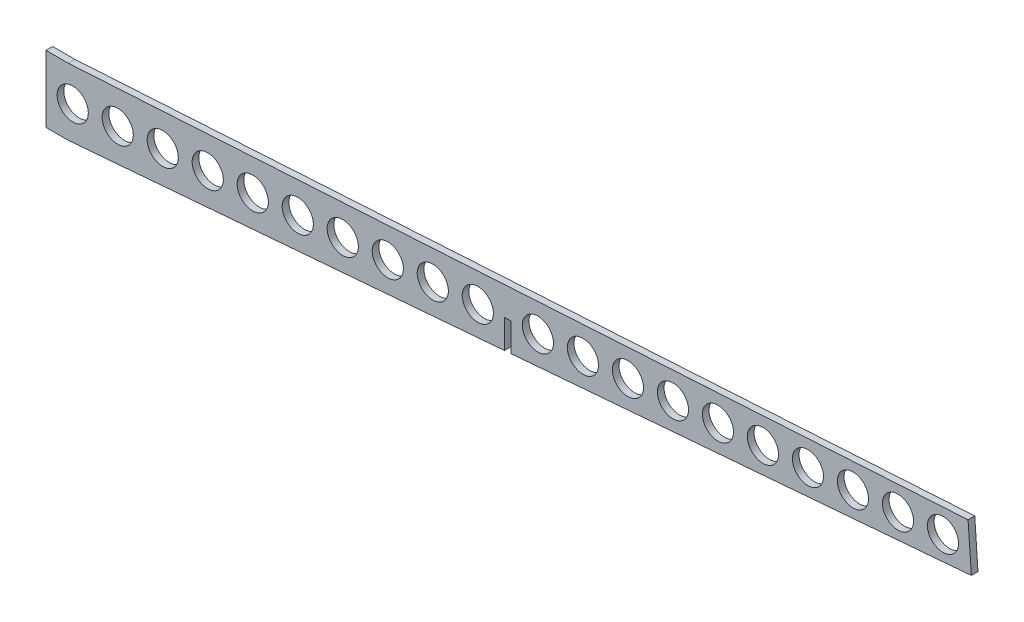
ISO-10303-21;
HEADER;
FILE_DESCRIPTION(('STEP AP214'),'2;1');
FILE_NAME('part.step','',(''),(''),'','','');
FILE_SCHEMA(('AUTOMOTIVE_DESIGN { 1 0 10303 214 1 1 1 1 }'));
ENDSEC;
DATA;
#1=APPLICATION_CONTEXT('core data for automotive mechanical design processes');
#2=APPLICATION_PROTOCOL_DEFINITION('international standard','automotive_design',2000,#1);
#3=PRODUCT_CONTEXT('',#1,'mechanical');
#4=PRODUCT('Part','Part','',(#3));
#5=PRODUCT_RELATED_PRODUCT_CATEGORY('part','',(#4));
#6=PRODUCT_DEFINITION_FORMATION('','',#4);
#7=PRODUCT_DEFINITION_CONTEXT('part definition',#1,'design');
#8=PRODUCT_DEFINITION('design','',#6,#7);
#9=PRODUCT_DEFINITION_SHAPE('','',#8);
#10=(LENGTH_UNIT() NAMED_UNIT(*) SI_UNIT(.MILLI.,.METRE.));
#11=(NAMED_UNIT(*) PLANE_ANGLE_UNIT() SI_UNIT($,.RADIAN.));
#12=(NAMED_UNIT(*) SI_UNIT($,.STERADIAN.) SOLID_ANGLE_UNIT());
#13=UNCERTAINTY_MEASURE_WITH_UNIT(LENGTH_MEASURE(1.E-05),#10,'distance_accuracy_value','');
#14=(GEOMETRIC_REPRESENTATION_CONTEXT(3) GLOBAL_UNCERTAINTY_ASSIGNED_CONTEXT((#13)) GLOBAL_UNIT_ASSIGNED_CONTEXT((#10,
#11,#12)) REPRESENTATION_CONTEXT('',''));
#15=CARTESIAN_POINT('',(0.,0.,0.));
#16=DIRECTION('',(0.,0.,1.));
#17=DIRECTION('',(1.,0.,0.));
#18=AXIS2_PLACEMENT_3D('',#15,#16,#17);
#19=CARTESIAN_POINT('',(-405.,0.,3.));
#20=DIRECTION('',(-0.0823970017996302,0.9965995856383,0.));
#21=DIRECTION('',(-0.9965995856383,-0.0823970017996302,0.));
#22=AXIS2_PLACEMENT_3D('',#19,#20,#21);
#23=PLANE('',#22);
#24=DIRECTION('',(0.9965995856383,0.0823970017996302,0.));
#25=VECTOR('',#24,1.);
#26=CARTESIAN_POINT('',(-405.,0.,3.));
#27=LINE('',#26,#25);
#28=CARTESIAN_POINT('',(-206.,16.4529502063003,3.));
#29=VERTEX_POINT('',#28);
#30=CARTESIAN_POINT('',(0.732442974313287,33.5452044288288,3.));
#31=VERTEX_POINT('',#30);
#32=EDGE_CURVE('E114',#29,#31,#27,.T.);
#33=ORIENTED_EDGE('',*,*,#32,.F.);
#34=DIRECTION('',(0.,0.,-1.));
#35=VECTOR('',#34,1.);
#36=CARTESIAN_POINT('',(-206.,16.4529502063003,3.));
#37=LINE('',#36,#35);
#38=CARTESIAN_POINT('',(-206.,16.4529502063003,0.));
#39=VERTEX_POINT('',#38);
#40=EDGE_CURVE('E312',#29,#39,#37,.T.);
#41=ORIENTED_EDGE('',*,*,#40,.T.);
#42=DIRECTION('',(0.9965995856383,0.0823970017996302,0.));
#43=VECTOR('',#42,1.);
#44=CARTESIAN_POINT('',(-405.,0.,0.));
#45=LINE('',#44,#43);
#46=CARTESIAN_POINT('',(0.732442974313287,33.5452044288288,0.));
#47=VERTEX_POINT('',#46);
#48=EDGE_CURVE('E132',#39,#47,#45,.T.);
#49=ORIENTED_EDGE('',*,*,#48,.T.);
#50=DIRECTION('',(0.,0.,-1.));
#51=VECTOR('',#50,1.);
#52=CARTESIAN_POINT('',(0.732442974313287,33.5452044288288,3.));
#53=LINE('',#52,#51);
#54=EDGE_CURVE('E130',#31,#47,#53,.T.);
#55=ORIENTED_EDGE('',*,*,#54,.F.);
#56=EDGE_LOOP('',(#33,#41,#49,#55));
#57=FACE_BOUND('',#56,.T.);
#58=ADVANCED_FACE('F43',(#57),#23,.F.);
#59=CARTESIAN_POINT('',(-415.,30.,3.));
#60=DIRECTION('',(0.,-1.,0.));
#61=DIRECTION('',(0.,0.,-1.));
#62=AXIS2_PLACEMENT_3D('',#59,#60,#61);
#63=PLANE('',#62);
#64=DIRECTION('',(-1.,0.,0.));
#65=VECTOR('',#64,1.);
#66=CARTESIAN_POINT('',(-415.,30.,0.));
#67=LINE('',#66,#65);
#68=CARTESIAN_POINT('',(-405.,30.,0.));
#69=VERTEX_POINT('',#68);
#70=CARTESIAN_POINT('',(-415.,30.,0.));
#71=VERTEX_POINT('',#70);
#72=EDGE_CURVE('E149',#69,#71,#67,.T.);
#73=ORIENTED_EDGE('',*,*,#72,.T.);
#74=DIRECTION('',(0.,0.,-1.));
#75=VECTOR('',#74,1.);
#76=CARTESIAN_POINT('',(-415.,30.,3.));
#77=LINE('',#76,#75);
#78=CARTESIAN_POINT('',(-415.,30.,3.));
#79=VERTEX_POINT('',#78);
#80=EDGE_CURVE('E52',#79,#71,#77,.T.);
#81=ORIENTED_EDGE('',*,*,#80,.F.);
#82=DIRECTION('',(-1.,0.,0.));
#83=VECTOR('',#82,1.);
#84=CARTESIAN_POINT('',(-415.,30.,3.));
#85=LINE('',#84,#83);
#86=CARTESIAN_POINT('',(-405.,30.,3.));
#87=VERTEX_POINT('',#86);
#88=EDGE_CURVE('E169',#87,#79,#85,.T.);
#89=ORIENTED_EDGE('',*,*,#88,.F.);
#90=DIRECTION('',(0.,0.,-1.));
#91=VECTOR('',#90,1.);
#92=CARTESIAN_POINT('',(-405.,30.,3.));
#93=LINE('',#92,#91);
#94=EDGE_CURVE('E144',#87,#69,#93,.T.);
#95=ORIENTED_EDGE('',*,*,#94,.T.);
#96=EDGE_LOOP('',(#73,#81,#89,#95));
#97=FACE_BOUND('',#96,.T.);
#98=ADVANCED_FACE('F45',(#97),#63,.F.);
#99=CARTESIAN_POINT('',(-415.,0.,3.));
#100=DIRECTION('',(1.,0.,0.));
#101=DIRECTION('',(0.,0.,-1.));
#102=AXIS2_PLACEMENT_3D('',#99,#100,#101);
#103=PLANE('',#102);
#104=DIRECTION('',(0.,-1.,0.));
#105=VECTOR('',#104,1.);
#106=CARTESIAN_POINT('',(-415.,0.,0.));
#107=LINE('',#106,#105);
#108=CARTESIAN_POINT('',(-415.,0.,0.));
#109=VERTEX_POINT('',#108);
#110=EDGE_CURVE('E153',#71,#109,#107,.T.);
#111=ORIENTED_EDGE('',*,*,#110,.T.);
#112=DIRECTION('',(0.,0.,-1.));
#113=VECTOR('',#112,1.);
#114=CARTESIAN_POINT('',(-415.,0.,3.));
#115=LINE('',#114,#113);
#116=CARTESIAN_POINT('',(-415.,0.,3.));
#117=VERTEX_POINT('',#116);
#118=EDGE_CURVE('E177',#117,#109,#115,.T.);
#119=ORIENTED_EDGE('',*,*,#118,.F.);
#120=DIRECTION('',(0.,-1.,0.));
#121=VECTOR('',#120,1.);
#122=CARTESIAN_POINT('',(-415.,0.,3.));
#123=LINE('',#122,#121);
#124=EDGE_CURVE('E104',#79,#117,#123,.T.);
#125=ORIENTED_EDGE('',*,*,#124,.F.);
#126=ORIENTED_EDGE('',*,*,#80,.T.);
#127=EDGE_LOOP('',(#111,#119,#125,#126));
#128=FACE_BOUND('',#127,.T.);
#129=ADVANCED_FACE('F182',(#128),#103,.F.);
#130=CARTESIAN_POINT('',(-415.,0.,3.));
#131=DIRECTION('',(0.,1.,0.));
#132=DIRECTION('',(0.,0.,1.));
#133=AXIS2_PLACEMENT_3D('',#130,#131,#132);
#134=PLANE('',#133);
#135=DIRECTION('',(1.,0.,0.));
#136=VECTOR('',#135,1.);
#137=CARTESIAN_POINT('',(-415.,0.,0.));
#138=LINE('',#137,#136);
#139=CARTESIAN_POINT('',(-405.,0.,0.));
#140=VERTEX_POINT('',#139);
#141=EDGE_CURVE('E157',#109,#140,#138,.T.);
#142=ORIENTED_EDGE('',*,*,#141,.T.);
#143=DIRECTION('',(0.,0.,-1.));
#144=VECTOR('',#143,1.);
#145=CARTESIAN_POINT('',(-405.,0.,3.));
#146=LINE('',#145,#144);
#147=CARTESIAN_POINT('',(-405.,0.,3.));
#148=VERTEX_POINT('',#147);
#149=EDGE_CURVE('E136',#148,#140,#146,.T.);
#150=ORIENTED_EDGE('',*,*,#149,.F.);
#151=DIRECTION('',(1.,0.,0.));
#152=VECTOR('',#151,1.);
#153=CARTESIAN_POINT('',(-415.,0.,3.));
#154=LINE('',#153,#152);
#155=EDGE_CURVE('E127',#117,#148,#154,.T.);
#156=ORIENTED_EDGE('',*,*,#155,.F.);
#157=ORIENTED_EDGE('',*,*,#118,.T.);
#158=EDGE_LOOP('',(#142,#150,#156,#157));
#159=FACE_BOUND('',#158,.T.);
#160=ADVANCED_FACE('F192',(#159),#134,.F.);
#161=CARTESIAN_POINT('',(-209.,16.2049157810796,0.));
#162=VERTEX_POINT('',#161);
#163=EDGE_CURVE('E160',#140,#162,#45,.T.);
#164=ORIENTED_EDGE('',*,*,#163,.T.);
#165=DIRECTION('',(0.,0.,1.));
#166=VECTOR('',#165,1.);
#167=CARTESIAN_POINT('',(-209.,16.2049157810796,0.));
#168=LINE('',#167,#166);
#169=CARTESIAN_POINT('',(-209.,16.2049157810796,3.));
#170=VERTEX_POINT('',#169);
#171=EDGE_CURVE('E200',#162,#170,#168,.T.);
#172=ORIENTED_EDGE('',*,*,#171,.T.);
#173=EDGE_CURVE('E126',#148,#170,#27,.T.);
#174=ORIENTED_EDGE('',*,*,#173,.F.);
#175=ORIENTED_EDGE('',*,*,#149,.T.);
#176=EDGE_LOOP('',(#164,#172,#174,#175));
#177=FACE_BOUND('',#176,.T.);
#178=ADVANCED_FACE('F196',(#177),#23,.F.);
#179=CARTESIAN_POINT('',(-0.732442974313352,54.4940494842851,3.));
#180=DIRECTION('',(-0.997564050259824,-0.0697564737441257,0.));
#181=DIRECTION('',(0.0697564737441257,-0.997564050259824,0.));
#182=AXIS2_PLACEMENT_3D('',#179,#180,#181);
#183=PLANE('',#182);
#184=DIRECTION('',(-0.0697564737441256,0.997564050259824,0.));
#185=VECTOR('',#184,1.);
#186=CARTESIAN_POINT('',(-0.732442974313352,54.4940494842851,0.));
#187=LINE('',#186,#185);
#188=CARTESIAN_POINT('',(-0.732442974313352,54.4940494842851,0.));
#189=VERTEX_POINT('',#188);
#190=EDGE_CURVE('E164',#47,#189,#187,.T.);
#191=ORIENTED_EDGE('',*,*,#190,.T.);
#192=DIRECTION('',(0.,0.,-1.));
#193=VECTOR('',#192,1.);
#194=CARTESIAN_POINT('',(-0.732442974313352,54.4940494842851,3.));
#195=LINE('',#194,#193);
#196=CARTESIAN_POINT('',(-0.732442974313352,54.4940494842851,3.));
#197=VERTEX_POINT('',#196);
#198=EDGE_CURVE('E137',#197,#189,#195,.T.);
#199=ORIENTED_EDGE('',*,*,#198,.F.);
#200=DIRECTION('',(-0.0697564737441256,0.997564050259824,0.));
#201=VECTOR('',#200,1.);
#202=CARTESIAN_POINT('',(-0.732442974313352,54.4940494842851,3.));
#203=LINE('',#202,#201);
#204=EDGE_CURVE('E118',#31,#197,#203,.T.);
#205=ORIENTED_EDGE('',*,*,#204,.F.);
#206=ORIENTED_EDGE('',*,*,#54,.T.);
#207=EDGE_LOOP('',(#191,#199,#205,#206));
#208=FACE_BOUND('',#207,.T.);
#209=ADVANCED_FACE('F139',(#208),#183,.F.);
#210=CARTESIAN_POINT('',(-405.,30.,3.));
#211=DIRECTION('',(0.0604778042120322,-0.99816954231117,0.));
#212=DIRECTION('',(0.99816954231117,0.0604778042120322,0.));
#213=AXIS2_PLACEMENT_3D('',#210,#211,#212);
#214=PLANE('',#213);
#215=DIRECTION('',(-0.99816954231117,-0.0604778042120322,0.));
#216=VECTOR('',#215,1.);
#217=CARTESIAN_POINT('',(-405.,30.,0.));
#218=LINE('',#217,#216);
#219=EDGE_CURVE('E95',#189,#69,#218,.T.);
#220=ORIENTED_EDGE('',*,*,#219,.T.);
#221=ORIENTED_EDGE('',*,*,#94,.F.);
#222=DIRECTION('',(-0.99816954231117,-0.0604778042120322,0.));
#223=VECTOR('',#222,1.);
#224=CARTESIAN_POINT('',(-405.,30.,3.));
#225=LINE('',#224,#223);
#226=EDGE_CURVE('E68',#197,#87,#225,.T.);
#227=ORIENTED_EDGE('',*,*,#226,.F.);
#228=ORIENTED_EDGE('',*,*,#198,.T.);
#229=EDGE_LOOP('',(#220,#221,#227,#228));
#230=FACE_BOUND('',#229,.T.);
#231=ADVANCED_FACE('F440',(#230),#214,.F.);
#232=CARTESIAN_POINT('',(0.,0.,3.));
#233=DIRECTION('',(0.,0.,1.));
#234=DIRECTION('',(1.,0.,0.));
#235=AXIS2_PLACEMENT_3D('',#232,#233,#234);
#236=PLANE('',#235);
#237=CARTESIAN_POINT('',(-12.0000000000001,43.1597861578442,3.));
#238=DIRECTION('',(0.,0.,1.));
#239=DIRECTION('',(1.,0.,0.));
#240=AXIS2_PLACEMENT_3D('',#237,#238,#239);
#241=CIRCLE('',#240,7.);
#242=CARTESIAN_POINT('',(-5.00000000000006,43.1597861578442,3.));
#243=VERTEX_POINT('',#242);
#244=EDGE_CURVE('E154',#243,#243,#241,.T.);
#245=ORIENTED_EDGE('',*,*,#244,.F.);
#246=EDGE_LOOP('',(#245));
#247=FACE_BOUND('',#246,.T.);
#248=CARTESIAN_POINT('',(-32.2222222222223,41.7107951822356,3.));
#249=DIRECTION('',(0.,0.,1.));
#250=DIRECTION('',(1.,0.,0.));
#251=AXIS2_PLACEMENT_3D('',#248,#249,#250);
#252=CIRCLE('',#251,7.);
#253=CARTESIAN_POINT('',(-25.2222222222223,41.7107951822356,3.));
#254=VERTEX_POINT('',#253);
#255=EDGE_CURVE('E236',#254,#254,#252,.T.);
#256=ORIENTED_EDGE('',*,*,#255,.F.);
#257=EDGE_LOOP('',(#256));
#258=FACE_BOUND('',#257,.T.);
#259=CARTESIAN_POINT('',(-52.4444444444445,40.2618042066269,3.));
#260=DIRECTION('',(0.,0.,1.));
#261=DIRECTION('',(1.,0.,0.));
#262=AXIS2_PLACEMENT_3D('',#259,#260,#261);
#263=CIRCLE('',#262,7.);
#264=CARTESIAN_POINT('',(-45.4444444444445,40.2618042066269,3.));
#265=VERTEX_POINT('',#264);
#266=EDGE_CURVE('E240',#265,#265,#263,.T.);
#267=ORIENTED_EDGE('',*,*,#266,.F.);
#268=EDGE_LOOP('',(#267));
#269=FACE_BOUND('',#268,.T.);
#270=CARTESIAN_POINT('',(-72.6666666666667,38.8128132310183,3.));
#271=DIRECTION('',(0.,0.,1.));
#272=DIRECTION('',(1.,0.,0.));
#273=AXIS2_PLACEMENT_3D('',#270,#271,#272);
#274=CIRCLE('',#273,7.);
#275=CARTESIAN_POINT('',(-65.6666666666667,38.8128132310183,3.));
#276=VERTEX_POINT('',#275);
#277=EDGE_CURVE('E244',#276,#276,#274,.T.);
#278=ORIENTED_EDGE('',*,*,#277,.F.);
#279=EDGE_LOOP('',(#278));
#280=FACE_BOUND('',#279,.T.);
#281=CARTESIAN_POINT('',(-92.8888888888889,37.3638222554097,3.));
#282=DIRECTION('',(0.,0.,1.));
#283=DIRECTION('',(1.,0.,0.));
#284=AXIS2_PLACEMENT_3D('',#281,#282,#283);
#285=CIRCLE('',#284,7.);
#286=CARTESIAN_POINT('',(-85.8888888888889,37.3638222554097,3.));
#287=VERTEX_POINT('',#286);
#288=EDGE_CURVE('E248',#287,#287,#285,.T.);
#289=ORIENTED_EDGE('',*,*,#288,.F.);
#290=EDGE_LOOP('',(#289));
#291=FACE_BOUND('',#290,.T.);
#292=CARTESIAN_POINT('',(-113.111111111111,35.9148312798011,3.));
#293=DIRECTION('',(0.,0.,1.));
#294=DIRECTION('',(1.,0.,0.));
#295=AXIS2_PLACEMENT_3D('',#292,#293,#294);
#296=CIRCLE('',#295,7.);
#297=CARTESIAN_POINT('',(-106.111111111111,35.9148312798011,3.));
#298=VERTEX_POINT('',#297);
#299=EDGE_CURVE('E252',#298,#298,#296,.T.);
#300=ORIENTED_EDGE('',*,*,#299,.F.);
#301=EDGE_LOOP('',(#300));
#302=FACE_BOUND('',#301,.T.);
#303=CARTESIAN_POINT('',(-133.333333333333,34.4658403041925,3.));
#304=DIRECTION('',(0.,0.,1.));
#305=DIRECTION('',(1.,0.,0.));
#306=AXIS2_PLACEMENT_3D('',#303,#304,#305);
#307=CIRCLE('',#306,7.00000000000002);
#308=CARTESIAN_POINT('',(-126.333333333333,34.4658403041925,3.));
#309=VERTEX_POINT('',#308);
#310=EDGE_CURVE('E256',#309,#309,#307,.T.);
#311=ORIENTED_EDGE('',*,*,#310,.F.);
#312=EDGE_LOOP('',(#311));
#313=FACE_BOUND('',#312,.T.);
#314=CARTESIAN_POINT('',(-153.555555555556,33.0168493285839,3.));
#315=DIRECTION('',(0.,0.,1.));
#316=DIRECTION('',(1.,0.,0.));
#317=AXIS2_PLACEMENT_3D('',#314,#315,#316);
#318=CIRCLE('',#317,7.00000000000002);
#319=CARTESIAN_POINT('',(-146.555555555556,33.0168493285839,3.));
#320=VERTEX_POINT('',#319);
#321=EDGE_CURVE('E260',#320,#320,#318,.T.);
#322=ORIENTED_EDGE('',*,*,#321,.F.);
#323=EDGE_LOOP('',(#322));
#324=FACE_BOUND('',#323,.T.);
#325=CARTESIAN_POINT('',(-173.777777777778,31.5678583529753,3.));
#326=DIRECTION('',(0.,0.,1.));
#327=DIRECTION('',(1.,0.,0.));
#328=AXIS2_PLACEMENT_3D('',#325,#326,#327);
#329=CIRCLE('',#328,7.00000000000002);
#330=CARTESIAN_POINT('',(-166.777777777778,31.5678583529753,3.));
#331=VERTEX_POINT('',#330);
#332=EDGE_CURVE('E264',#331,#331,#329,.T.);
#333=ORIENTED_EDGE('',*,*,#332,.F.);
#334=EDGE_LOOP('',(#333));
#335=FACE_BOUND('',#334,.T.);
#336=CARTESIAN_POINT('',(-194.,30.1188673773667,3.));
#337=DIRECTION('',(0.,0.,1.));
#338=DIRECTION('',(1.,0.,0.));
#339=AXIS2_PLACEMENT_3D('',#336,#337,#338);
#340=CIRCLE('',#339,7.00000000000002);
#341=CARTESIAN_POINT('',(-187.,30.1188673773667,3.));
#342=VERTEX_POINT('',#341);
#343=EDGE_CURVE('E268',#342,#342,#340,.T.);
#344=ORIENTED_EDGE('',*,*,#343,.F.);
#345=EDGE_LOOP('',(#344));
#346=FACE_BOUND('',#345,.T.);
#347=CARTESIAN_POINT('',(-221.,28.1842255802629,3.));
#348=DIRECTION('',(0.,0.,1.));
#349=DIRECTION('',(1.,0.,0.));
#350=AXIS2_PLACEMENT_3D('',#347,#348,#349);
#351=CIRCLE('',#350,6.99999999999999);
#352=CARTESIAN_POINT('',(-214.,28.1842255802629,3.));
#353=VERTEX_POINT('',#352);
#354=EDGE_CURVE('E272',#353,#353,#351,.T.);
#355=ORIENTED_EDGE('',*,*,#354,.F.);
#356=EDGE_LOOP('',(#355));
#357=FACE_BOUND('',#356,.T.);
#358=CARTESIAN_POINT('',(-241.222222222222,26.7352346046543,3.));
#359=DIRECTION('',(0.,0.,1.));
#360=DIRECTION('',(1.,0.,0.));
#361=AXIS2_PLACEMENT_3D('',#358,#359,#360);
#362=CIRCLE('',#361,6.99999999999999);
#363=CARTESIAN_POINT('',(-234.222222222222,26.7352346046543,3.));
#364=VERTEX_POINT('',#363);
#365=EDGE_CURVE('E276',#364,#364,#362,.T.);
#366=ORIENTED_EDGE('',*,*,#365,.F.);
#367=EDGE_LOOP('',(#366));
#368=FACE_BOUND('',#367,.T.);
#369=CARTESIAN_POINT('',(-261.444444444444,25.2862436290457,3.));
#370=DIRECTION('',(0.,0.,1.));
#371=DIRECTION('',(1.,0.,0.));
#372=AXIS2_PLACEMENT_3D('',#369,#370,#371);
#373=CIRCLE('',#372,6.99999999999993);
#374=CARTESIAN_POINT('',(-254.444444444444,25.2862436290457,3.));
#375=VERTEX_POINT('',#374);
#376=EDGE_CURVE('E280',#375,#375,#373,.T.);
#377=ORIENTED_EDGE('',*,*,#376,.F.);
#378=EDGE_LOOP('',(#377));
#379=FACE_BOUND('',#378,.T.);
#380=CARTESIAN_POINT('',(-281.666666666667,23.8372526534371,3.));
#381=DIRECTION('',(0.,0.,1.));
#382=DIRECTION('',(1.,0.,0.));
#383=AXIS2_PLACEMENT_3D('',#380,#381,#382);
#384=CIRCLE('',#383,7.00000000000005);
#385=CARTESIAN_POINT('',(-274.666666666667,23.8372526534371,3.));
#386=VERTEX_POINT('',#385);
#387=EDGE_CURVE('E284',#386,#386,#384,.T.);
#388=ORIENTED_EDGE('',*,*,#387,.F.);
#389=EDGE_LOOP('',(#388));
#390=FACE_BOUND('',#389,.T.);
#391=CARTESIAN_POINT('',(-301.888888888889,22.3882616778285,3.));
#392=DIRECTION('',(0.,0.,1.));
#393=DIRECTION('',(1.,0.,0.));
#394=AXIS2_PLACEMENT_3D('',#391,#392,#393);
#395=CIRCLE('',#394,6.99999999999999);
#396=CARTESIAN_POINT('',(-294.888888888889,22.3882616778285,3.));
#397=VERTEX_POINT('',#396);
#398=EDGE_CURVE('E288',#397,#397,#395,.T.);
#399=ORIENTED_EDGE('',*,*,#398,.F.);
#400=EDGE_LOOP('',(#399));
#401=FACE_BOUND('',#400,.T.);
#402=CARTESIAN_POINT('',(-322.111111111111,20.9392707022199,3.));
#403=DIRECTION('',(0.,0.,1.));
#404=DIRECTION('',(1.,0.,0.));
#405=AXIS2_PLACEMENT_3D('',#402,#403,#404);
#406=CIRCLE('',#405,6.99999999999999);
#407=CARTESIAN_POINT('',(-315.111111111111,20.9392707022199,3.));
#408=VERTEX_POINT('',#407);
#409=EDGE_CURVE('E292',#408,#408,#406,.T.);
#410=ORIENTED_EDGE('',*,*,#409,.F.);
#411=EDGE_LOOP('',(#410));
#412=FACE_BOUND('',#411,.T.);
#413=CARTESIAN_POINT('',(-342.333333333333,19.4902797266113,3.));
#414=DIRECTION('',(0.,0.,1.));
#415=DIRECTION('',(1.,0.,0.));
#416=AXIS2_PLACEMENT_3D('',#413,#414,#415);
#417=CIRCLE('',#416,6.99999999999999);
#418=CARTESIAN_POINT('',(-335.333333333333,19.4902797266113,3.));
#419=VERTEX_POINT('',#418);
#420=EDGE_CURVE('E296',#419,#419,#417,.T.);
#421=ORIENTED_EDGE('',*,*,#420,.F.);
#422=EDGE_LOOP('',(#421));
#423=FACE_BOUND('',#422,.T.);
#424=CARTESIAN_POINT('',(-362.555555555556,18.0412887510027,3.));
#425=DIRECTION('',(0.,0.,1.));
#426=DIRECTION('',(1.,0.,0.));
#427=AXIS2_PLACEMENT_3D('',#424,#425,#426);
#428=CIRCLE('',#427,6.99999999999999);
#429=CARTESIAN_POINT('',(-355.555555555555,18.0412887510027,3.));
#430=VERTEX_POINT('',#429);
#431=EDGE_CURVE('E300',#430,#430,#428,.T.);
#432=ORIENTED_EDGE('',*,*,#431,.F.);
#433=EDGE_LOOP('',(#432));
#434=FACE_BOUND('',#433,.T.);
#435=CARTESIAN_POINT('',(-382.777777777778,16.5922977753941,3.));
#436=DIRECTION('',(0.,0.,1.));
#437=DIRECTION('',(1.,0.,0.));
#438=AXIS2_PLACEMENT_3D('',#435,#436,#437);
#439=CIRCLE('',#438,6.99999999999999);
#440=CARTESIAN_POINT('',(-375.777777777778,16.5922977753941,3.));
#441=VERTEX_POINT('',#440);
#442=EDGE_CURVE('E304',#441,#441,#439,.T.);
#443=ORIENTED_EDGE('',*,*,#442,.F.);
#444=EDGE_LOOP('',(#443));
#445=FACE_BOUND('',#444,.T.);
#446=CARTESIAN_POINT('',(-403.,15.1433067997855,3.));
#447=DIRECTION('',(0.,0.,1.));
#448=DIRECTION('',(1.,0.,0.));
#449=AXIS2_PLACEMENT_3D('',#446,#447,#448);
#450=CIRCLE('',#449,6.99999999999999);
#451=CARTESIAN_POINT('',(-396.,15.1433067997855,3.));
#452=VERTEX_POINT('',#451);
#453=EDGE_CURVE('E308',#452,#452,#450,.T.);
#454=ORIENTED_EDGE('',*,*,#453,.F.);
#455=EDGE_LOOP('',(#454));
#456=FACE_BOUND('',#455,.T.);
#457=DIRECTION('',(0.,1.,0.));
#458=VECTOR('',#457,1.);
#459=CARTESIAN_POINT('',(-206.,-8.83264334993316E-13,3.));
#460=LINE('',#459,#458);
#461=CARTESIAN_POINT('',(-206.,29.1515464788148,3.));
#462=VERTEX_POINT('',#461);
#463=EDGE_CURVE('E122',#29,#462,#460,.T.);
#464=ORIENTED_EDGE('',*,*,#463,.F.);
#465=ORIENTED_EDGE('',*,*,#32,.T.);
#466=ORIENTED_EDGE('',*,*,#204,.T.);
#467=ORIENTED_EDGE('',*,*,#226,.T.);
#468=ORIENTED_EDGE('',*,*,#88,.T.);
#469=ORIENTED_EDGE('',*,*,#124,.T.);
#470=ORIENTED_EDGE('',*,*,#155,.T.);
#471=ORIENTED_EDGE('',*,*,#173,.T.);
#472=DIRECTION('',(0.,-1.,0.));
#473=VECTOR('',#472,1.);
#474=CARTESIAN_POINT('',(-209.,0.,3.));
#475=LINE('',#474,#473);
#476=CARTESIAN_POINT('',(-209.,29.1515464788148,3.));
#477=VERTEX_POINT('',#476);
#478=EDGE_CURVE('E204',#477,#170,#475,.T.);
#479=ORIENTED_EDGE('',*,*,#478,.F.);
#480=DIRECTION('',(-1.,0.,0.));
#481=VECTOR('',#480,1.);
#482=CARTESIAN_POINT('',(0.,29.1515464788148,3.));
#483=LINE('',#482,#481);
#484=EDGE_CURVE('E319',#462,#477,#483,.T.);
#485=ORIENTED_EDGE('',*,*,#484,.F.);
#486=EDGE_LOOP('',(#464,#465,#466,#467,#468,#469,#470,#471,#479,#485));
#487=FACE_BOUND('',#486,.T.);
#488=ADVANCED_FACE('F116',(#247,#258,#269,#280,#291,#302,#313,#324,#335,#346,#357,#368,#379,
#390,#401,#412,#423,#434,#445,#456,#487),#236,.T.);
#489=CARTESIAN_POINT('',(0.,0.,0.));
#490=DIRECTION('',(0.,0.,1.));
#491=DIRECTION('',(1.,0.,0.));
#492=AXIS2_PLACEMENT_3D('',#489,#490,#491);
#493=PLANE('',#492);
#494=CARTESIAN_POINT('',(-12.0000000000001,43.1597861578442,0.));
#495=DIRECTION('',(0.,0.,1.));
#496=DIRECTION('',(1.,0.,0.));
#497=AXIS2_PLACEMENT_3D('',#494,#495,#496);
#498=CIRCLE('',#497,7.);
#499=CARTESIAN_POINT('',(-5.00000000000006,43.1597861578442,0.));
#500=VERTEX_POINT('',#499);
#501=EDGE_CURVE('E403',#500,#500,#498,.T.);
#502=ORIENTED_EDGE('',*,*,#501,.T.);
#503=EDGE_LOOP('',(#502));
#504=FACE_BOUND('',#503,.T.);
#505=CARTESIAN_POINT('',(-32.2222222222223,41.7107951822356,0.));
#506=DIRECTION('',(0.,0.,1.));
#507=DIRECTION('',(1.,0.,0.));
#508=AXIS2_PLACEMENT_3D('',#505,#506,#507);
#509=CIRCLE('',#508,7.);
#510=CARTESIAN_POINT('',(-25.2222222222223,41.7107951822356,0.));
#511=VERTEX_POINT('',#510);
#512=EDGE_CURVE('E399',#511,#511,#509,.T.);
#513=ORIENTED_EDGE('',*,*,#512,.T.);
#514=EDGE_LOOP('',(#513));
#515=FACE_BOUND('',#514,.T.);
#516=CARTESIAN_POINT('',(-52.4444444444445,40.2618042066269,0.));
#517=DIRECTION('',(0.,0.,1.));
#518=DIRECTION('',(1.,0.,0.));
#519=AXIS2_PLACEMENT_3D('',#516,#517,#518);
#520=CIRCLE('',#519,7.);
#521=CARTESIAN_POINT('',(-45.4444444444445,40.2618042066269,0.));
#522=VERTEX_POINT('',#521);
#523=EDGE_CURVE('E395',#522,#522,#520,.T.);
#524=ORIENTED_EDGE('',*,*,#523,.T.);
#525=EDGE_LOOP('',(#524));
#526=FACE_BOUND('',#525,.T.);
#527=CARTESIAN_POINT('',(-72.6666666666667,38.8128132310183,0.));
#528=DIRECTION('',(0.,0.,1.));
#529=DIRECTION('',(1.,0.,0.));
#530=AXIS2_PLACEMENT_3D('',#527,#528,#529);
#531=CIRCLE('',#530,7.);
#532=CARTESIAN_POINT('',(-65.6666666666667,38.8128132310183,0.));
#533=VERTEX_POINT('',#532);
#534=EDGE_CURVE('E391',#533,#533,#531,.T.);
#535=ORIENTED_EDGE('',*,*,#534,.T.);
#536=EDGE_LOOP('',(#535));
#537=FACE_BOUND('',#536,.T.);
#538=CARTESIAN_POINT('',(-92.8888888888889,37.3638222554097,0.));
#539=DIRECTION('',(0.,0.,1.));
#540=DIRECTION('',(1.,0.,0.));
#541=AXIS2_PLACEMENT_3D('',#538,#539,#540);
#542=CIRCLE('',#541,7.);
#543=CARTESIAN_POINT('',(-85.8888888888889,37.3638222554097,0.));
#544=VERTEX_POINT('',#543);
#545=EDGE_CURVE('E387',#544,#544,#542,.T.);
#546=ORIENTED_EDGE('',*,*,#545,.T.);
#547=EDGE_LOOP('',(#546));
#548=FACE_BOUND('',#547,.T.);
#549=CARTESIAN_POINT('',(-113.111111111111,35.9148312798011,0.));
#550=DIRECTION('',(0.,0.,1.));
#551=DIRECTION('',(1.,0.,0.));
#552=AXIS2_PLACEMENT_3D('',#549,#550,#551);
#553=CIRCLE('',#552,7.);
#554=CARTESIAN_POINT('',(-106.111111111111,35.9148312798011,0.));
#555=VERTEX_POINT('',#554);
#556=EDGE_CURVE('E383',#555,#555,#553,.T.);
#557=ORIENTED_EDGE('',*,*,#556,.T.);
#558=EDGE_LOOP('',(#557));
#559=FACE_BOUND('',#558,.T.);
#560=CARTESIAN_POINT('',(-133.333333333333,34.4658403041925,0.));
#561=DIRECTION('',(0.,0.,1.));
#562=DIRECTION('',(1.,0.,0.));
#563=AXIS2_PLACEMENT_3D('',#560,#561,#562);
#564=CIRCLE('',#563,7.00000000000002);
#565=CARTESIAN_POINT('',(-126.333333333333,34.4658403041925,0.));
#566=VERTEX_POINT('',#565);
#567=EDGE_CURVE('E379',#566,#566,#564,.T.);
#568=ORIENTED_EDGE('',*,*,#567,.T.);
#569=EDGE_LOOP('',(#568));
#570=FACE_BOUND('',#569,.T.);
#571=CARTESIAN_POINT('',(-153.555555555556,33.0168493285839,0.));
#572=DIRECTION('',(0.,0.,1.));
#573=DIRECTION('',(1.,0.,0.));
#574=AXIS2_PLACEMENT_3D('',#571,#572,#573);
#575=CIRCLE('',#574,7.00000000000002);
#576=CARTESIAN_POINT('',(-146.555555555556,33.0168493285839,0.));
#577=VERTEX_POINT('',#576);
#578=EDGE_CURVE('E375',#577,#577,#575,.T.);
#579=ORIENTED_EDGE('',*,*,#578,.T.);
#580=EDGE_LOOP('',(#579));
#581=FACE_BOUND('',#580,.T.);
#582=CARTESIAN_POINT('',(-173.777777777778,31.5678583529753,0.));
#583=DIRECTION('',(0.,0.,1.));
#584=DIRECTION('',(1.,0.,0.));
#585=AXIS2_PLACEMENT_3D('',#582,#583,#584);
#586=CIRCLE('',#585,7.00000000000002);
#587=CARTESIAN_POINT('',(-166.777777777778,31.5678583529753,0.));
#588=VERTEX_POINT('',#587);
#589=EDGE_CURVE('E371',#588,#588,#586,.T.);
#590=ORIENTED_EDGE('',*,*,#589,.T.);
#591=EDGE_LOOP('',(#590));
#592=FACE_BOUND('',#591,.T.);
#593=CARTESIAN_POINT('',(-194.,30.1188673773667,0.));
#594=DIRECTION('',(0.,0.,1.));
#595=DIRECTION('',(1.,0.,0.));
#596=AXIS2_PLACEMENT_3D('',#593,#594,#595);
#597=CIRCLE('',#596,7.00000000000002);
#598=CARTESIAN_POINT('',(-187.,30.1188673773667,0.));
#599=VERTEX_POINT('',#598);
#600=EDGE_CURVE('E367',#599,#599,#597,.T.);
#601=ORIENTED_EDGE('',*,*,#600,.T.);
#602=EDGE_LOOP('',(#601));
#603=FACE_BOUND('',#602,.T.);
#604=CARTESIAN_POINT('',(-221.,28.1842255802629,0.));
#605=DIRECTION('',(0.,0.,1.));
#606=DIRECTION('',(1.,0.,0.));
#607=AXIS2_PLACEMENT_3D('',#604,#605,#606);
#608=CIRCLE('',#607,6.99999999999999);
#609=CARTESIAN_POINT('',(-214.,28.1842255802629,0.));
#610=VERTEX_POINT('',#609);
#611=EDGE_CURVE('E363',#610,#610,#608,.T.);
#612=ORIENTED_EDGE('',*,*,#611,.T.);
#613=EDGE_LOOP('',(#612));
#614=FACE_BOUND('',#613,.T.);
#615=CARTESIAN_POINT('',(-241.222222222222,26.7352346046543,0.));
#616=DIRECTION('',(0.,0.,1.));
#617=DIRECTION('',(1.,0.,0.));
#618=AXIS2_PLACEMENT_3D('',#615,#616,#617);
#619=CIRCLE('',#618,6.99999999999999);
#620=CARTESIAN_POINT('',(-234.222222222222,26.7352346046543,0.));
#621=VERTEX_POINT('',#620);
#622=EDGE_CURVE('E359',#621,#621,#619,.T.);
#623=ORIENTED_EDGE('',*,*,#622,.T.);
#624=EDGE_LOOP('',(#623));
#625=FACE_BOUND('',#624,.T.);
#626=CARTESIAN_POINT('',(-261.444444444444,25.2862436290457,0.));
#627=DIRECTION('',(0.,0.,1.));
#628=DIRECTION('',(1.,0.,0.));
#629=AXIS2_PLACEMENT_3D('',#626,#627,#628);
#630=CIRCLE('',#629,6.99999999999993);
#631=CARTESIAN_POINT('',(-254.444444444444,25.2862436290457,0.));
#632=VERTEX_POINT('',#631);
#633=EDGE_CURVE('E355',#632,#632,#630,.T.);
#634=ORIENTED_EDGE('',*,*,#633,.T.);
#635=EDGE_LOOP('',(#634));
#636=FACE_BOUND('',#635,.T.);
#637=CARTESIAN_POINT('',(-281.666666666667,23.8372526534371,0.));
#638=DIRECTION('',(0.,0.,1.));
#639=DIRECTION('',(1.,0.,0.));
#640=AXIS2_PLACEMENT_3D('',#637,#638,#639);
#641=CIRCLE('',#640,7.00000000000005);
#642=CARTESIAN_POINT('',(-274.666666666667,23.8372526534371,0.));
#643=VERTEX_POINT('',#642);
#644=EDGE_CURVE('E351',#643,#643,#641,.T.);
#645=ORIENTED_EDGE('',*,*,#644,.T.);
#646=EDGE_LOOP('',(#645));
#647=FACE_BOUND('',#646,.T.);
#648=CARTESIAN_POINT('',(-301.888888888889,22.3882616778285,0.));
#649=DIRECTION('',(0.,0.,1.));
#650=DIRECTION('',(1.,0.,0.));
#651=AXIS2_PLACEMENT_3D('',#648,#649,#650);
#652=CIRCLE('',#651,6.99999999999999);
#653=CARTESIAN_POINT('',(-294.888888888889,22.3882616778285,0.));
#654=VERTEX_POINT('',#653);
#655=EDGE_CURVE('E347',#654,#654,#652,.T.);
#656=ORIENTED_EDGE('',*,*,#655,.T.);
#657=EDGE_LOOP('',(#656));
#658=FACE_BOUND('',#657,.T.);
#659=CARTESIAN_POINT('',(-322.111111111111,20.9392707022199,0.));
#660=DIRECTION('',(0.,0.,1.));
#661=DIRECTION('',(1.,0.,0.));
#662=AXIS2_PLACEMENT_3D('',#659,#660,#661);
#663=CIRCLE('',#662,6.99999999999999);
#664=CARTESIAN_POINT('',(-315.111111111111,20.9392707022199,0.));
#665=VERTEX_POINT('',#664);
#666=EDGE_CURVE('E343',#665,#665,#663,.T.);
#667=ORIENTED_EDGE('',*,*,#666,.T.);
#668=EDGE_LOOP('',(#667));
#669=FACE_BOUND('',#668,.T.);
#670=CARTESIAN_POINT('',(-342.333333333333,19.4902797266113,0.));
#671=DIRECTION('',(0.,0.,1.));
#672=DIRECTION('',(1.,0.,0.));
#673=AXIS2_PLACEMENT_3D('',#670,#671,#672);
#674=CIRCLE('',#673,6.99999999999999);
#675=CARTESIAN_POINT('',(-335.333333333333,19.4902797266113,0.));
#676=VERTEX_POINT('',#675);
#677=EDGE_CURVE('E339',#676,#676,#674,.T.);
#678=ORIENTED_EDGE('',*,*,#677,.T.);
#679=EDGE_LOOP('',(#678));
#680=FACE_BOUND('',#679,.T.);
#681=CARTESIAN_POINT('',(-362.555555555556,18.0412887510027,0.));
#682=DIRECTION('',(0.,0.,1.));
#683=DIRECTION('',(1.,0.,0.));
#684=AXIS2_PLACEMENT_3D('',#681,#682,#683);
#685=CIRCLE('',#684,6.99999999999999);
#686=CARTESIAN_POINT('',(-355.555555555555,18.0412887510027,0.));
#687=VERTEX_POINT('',#686);
#688=EDGE_CURVE('E335',#687,#687,#685,.T.);
#689=ORIENTED_EDGE('',*,*,#688,.T.);
#690=EDGE_LOOP('',(#689));
#691=FACE_BOUND('',#690,.T.);
#692=CARTESIAN_POINT('',(-382.777777777778,16.5922977753941,0.));
#693=DIRECTION('',(0.,0.,1.));
#694=DIRECTION('',(1.,0.,0.));
#695=AXIS2_PLACEMENT_3D('',#692,#693,#694);
#696=CIRCLE('',#695,6.99999999999999);
#697=CARTESIAN_POINT('',(-375.777777777778,16.5922977753941,0.));
#698=VERTEX_POINT('',#697);
#699=EDGE_CURVE('E331',#698,#698,#696,.T.);
#700=ORIENTED_EDGE('',*,*,#699,.T.);
#701=EDGE_LOOP('',(#700));
#702=FACE_BOUND('',#701,.T.);
#703=CARTESIAN_POINT('',(-403.,15.1433067997855,0.));
#704=DIRECTION('',(0.,0.,1.));
#705=DIRECTION('',(1.,0.,0.));
#706=AXIS2_PLACEMENT_3D('',#703,#704,#705);
#707=CIRCLE('',#706,6.99999999999999);
#708=CARTESIAN_POINT('',(-396.,15.1433067997855,0.));
#709=VERTEX_POINT('',#708);
#710=EDGE_CURVE('E230',#709,#709,#707,.T.);
#711=ORIENTED_EDGE('',*,*,#710,.T.);
#712=EDGE_LOOP('',(#711));
#713=FACE_BOUND('',#712,.T.);
#714=ORIENTED_EDGE('',*,*,#48,.F.);
#715=DIRECTION('',(0.,1.,0.));
#716=VECTOR('',#715,1.);
#717=CARTESIAN_POINT('',(-206.,-8.83264334993316E-13,0.));
#718=LINE('',#717,#716);
#719=CARTESIAN_POINT('',(-206.,29.1515464788148,0.));
#720=VERTEX_POINT('',#719);
#721=EDGE_CURVE('E11',#39,#720,#718,.T.);
#722=ORIENTED_EDGE('',*,*,#721,.T.);
#723=DIRECTION('',(-1.,0.,0.));
#724=VECTOR('',#723,1.);
#725=CARTESIAN_POINT('',(-209.,29.1515464788148,0.));
#726=LINE('',#725,#724);
#727=CARTESIAN_POINT('',(-209.,29.1515464788148,0.));
#728=VERTEX_POINT('',#727);
#729=EDGE_CURVE('E227',#720,#728,#726,.T.);
#730=ORIENTED_EDGE('',*,*,#729,.T.);
#731=DIRECTION('',(0.,-1.,0.));
#732=VECTOR('',#731,1.);
#733=CARTESIAN_POINT('',(-209.,29.1515464788148,0.));
#734=LINE('',#733,#732);
#735=EDGE_CURVE('E59',#728,#162,#734,.T.);
#736=ORIENTED_EDGE('',*,*,#735,.T.);
#737=ORIENTED_EDGE('',*,*,#163,.F.);
#738=ORIENTED_EDGE('',*,*,#141,.F.);
#739=ORIENTED_EDGE('',*,*,#110,.F.);
#740=ORIENTED_EDGE('',*,*,#72,.F.);
#741=ORIENTED_EDGE('',*,*,#219,.F.);
#742=ORIENTED_EDGE('',*,*,#190,.F.);
#743=EDGE_LOOP('',(#714,#722,#730,#736,#737,#738,#739,#740,#741,#742));
#744=FACE_BOUND('',#743,.T.);
#745=ADVANCED_FACE('F187',(#504,#515,#526,#537,#548,#559,#570,#581,#592,#603,#614,#625,#636,
#647,#658,#669,#680,#691,#702,#713,#744),#493,.F.);
#746=CARTESIAN_POINT('',(-206.,16.2049157810796,0.));
#747=DIRECTION('',(1.,0.,0.));
#748=DIRECTION('',(0.,1.,0.));
#749=AXIS2_PLACEMENT_3D('',#746,#747,#748);
#750=PLANE('',#749);
#751=ORIENTED_EDGE('',*,*,#463,.T.);
#752=DIRECTION('',(0.,0.,1.));
#753=VECTOR('',#752,1.);
#754=CARTESIAN_POINT('',(-206.,29.1515464788148,0.));
#755=LINE('',#754,#753);
#756=EDGE_CURVE('E218',#720,#462,#755,.T.);
#757=ORIENTED_EDGE('',*,*,#756,.F.);
#758=ORIENTED_EDGE('',*,*,#721,.F.);
#759=ORIENTED_EDGE('',*,*,#40,.F.);
#760=EDGE_LOOP('',(#751,#757,#758,#759));
#761=FACE_BOUND('',#760,.T.);
#762=ADVANCED_FACE('F220',(#761),#750,.F.);
#763=CARTESIAN_POINT('',(-209.,29.1515464788148,0.));
#764=DIRECTION('',(-1.,0.,0.));
#765=DIRECTION('',(0.,0.,1.));
#766=AXIS2_PLACEMENT_3D('',#763,#764,#765);
#767=PLANE('',#766);
#768=ORIENTED_EDGE('',*,*,#478,.T.);
#769=ORIENTED_EDGE('',*,*,#171,.F.);
#770=ORIENTED_EDGE('',*,*,#735,.F.);
#771=DIRECTION('',(0.,0.,1.));
#772=VECTOR('',#771,1.);
#773=CARTESIAN_POINT('',(-209.,29.1515464788148,0.));
#774=LINE('',#773,#772);
#775=EDGE_CURVE('E224',#728,#477,#774,.T.);
#776=ORIENTED_EDGE('',*,*,#775,.T.);
#777=EDGE_LOOP('',(#768,#769,#770,#776));
#778=FACE_BOUND('',#777,.T.);
#779=ADVANCED_FACE('F519',(#778),#767,.F.);
#780=CARTESIAN_POINT('',(-209.,29.1515464788148,0.));
#781=DIRECTION('',(0.,1.,0.));
#782=DIRECTION('',(0.,0.,1.));
#783=AXIS2_PLACEMENT_3D('',#780,#781,#782);
#784=PLANE('',#783);
#785=ORIENTED_EDGE('',*,*,#484,.T.);
#786=ORIENTED_EDGE('',*,*,#775,.F.);
#787=ORIENTED_EDGE('',*,*,#729,.F.);
#788=ORIENTED_EDGE('',*,*,#756,.T.);
#789=EDGE_LOOP('',(#785,#786,#787,#788));
#790=FACE_BOUND('',#789,.T.);
#791=ADVANCED_FACE('F228',(#790),#784,.F.);
#792=CARTESIAN_POINT('',(-403.,15.1433067997855,0.));
#793=DIRECTION('',(0.,0.,1.));
#794=DIRECTION('',(1.,0.,0.));
#795=AXIS2_PLACEMENT_3D('',#792,#793,#794);
#796=CYLINDRICAL_SURFACE('',#795,6.99999999999999);
#797=ORIENTED_EDGE('',*,*,#453,.T.);
#798=EDGE_LOOP('',(#797));
#799=FACE_BOUND('',#798,.T.);
#800=ORIENTED_EDGE('',*,*,#710,.F.);
#801=EDGE_LOOP('',(#800));
#802=FACE_BOUND('',#801,.T.);
#803=ADVANCED_FACE('F537',(#799,#802),#796,.F.);
#804=CARTESIAN_POINT('',(-382.777777777778,16.5922977753941,0.));
#805=DIRECTION('',(0.,0.,1.));
#806=DIRECTION('',(1.,0.,0.));
#807=AXIS2_PLACEMENT_3D('',#804,#805,#806);
#808=CYLINDRICAL_SURFACE('',#807,6.99999999999999);
#809=ORIENTED_EDGE('',*,*,#442,.T.);
#810=EDGE_LOOP('',(#809));
#811=FACE_BOUND('',#810,.T.);
#812=ORIENTED_EDGE('',*,*,#699,.F.);
#813=EDGE_LOOP('',(#812));
#814=FACE_BOUND('',#813,.T.);
#815=ADVANCED_FACE('F547',(#811,#814),#808,.F.);
#816=CARTESIAN_POINT('',(-362.555555555556,18.0412887510027,0.));
#817=DIRECTION('',(0.,0.,1.));
#818=DIRECTION('',(1.,0.,0.));
#819=AXIS2_PLACEMENT_3D('',#816,#817,#818);
#820=CYLINDRICAL_SURFACE('',#819,6.99999999999999);
#821=ORIENTED_EDGE('',*,*,#431,.T.);
#822=EDGE_LOOP('',(#821));
#823=FACE_BOUND('',#822,.T.);
#824=ORIENTED_EDGE('',*,*,#688,.F.);
#825=EDGE_LOOP('',(#824));
#826=FACE_BOUND('',#825,.T.);
#827=ADVANCED_FACE('F558',(#823,#826),#820,.F.);
#828=CARTESIAN_POINT('',(-342.333333333333,19.4902797266113,0.));
#829=DIRECTION('',(0.,0.,1.));
#830=DIRECTION('',(1.,0.,0.));
#831=AXIS2_PLACEMENT_3D('',#828,#829,#830);
#832=CYLINDRICAL_SURFACE('',#831,6.99999999999999);
#833=ORIENTED_EDGE('',*,*,#420,.T.);
#834=EDGE_LOOP('',(#833));
#835=FACE_BOUND('',#834,.T.);
#836=ORIENTED_EDGE('',*,*,#677,.F.);
#837=EDGE_LOOP('',(#836));
#838=FACE_BOUND('',#837,.T.);
#839=ADVANCED_FACE('F569',(#835,#838),#832,.F.);
#840=CARTESIAN_POINT('',(-322.111111111111,20.9392707022199,0.));
#841=DIRECTION('',(0.,0.,1.));
#842=DIRECTION('',(1.,0.,0.));
#843=AXIS2_PLACEMENT_3D('',#840,#841,#842);
#844=CYLINDRICAL_SURFACE('',#843,6.99999999999999);
#845=ORIENTED_EDGE('',*,*,#409,.T.);
#846=EDGE_LOOP('',(#845));
#847=FACE_BOUND('',#846,.T.);
#848=ORIENTED_EDGE('',*,*,#666,.F.);
#849=EDGE_LOOP('',(#848));
#850=FACE_BOUND('',#849,.T.);
#851=ADVANCED_FACE('F580',(#847,#850),#844,.F.);
#852=CARTESIAN_POINT('',(-301.888888888889,22.3882616778285,0.));
#853=DIRECTION('',(0.,0.,1.));
#854=DIRECTION('',(1.,0.,0.));
#855=AXIS2_PLACEMENT_3D('',#852,#853,#854);
#856=CYLINDRICAL_SURFACE('',#855,6.99999999999999);
#857=ORIENTED_EDGE('',*,*,#398,.T.);
#858=EDGE_LOOP('',(#857));
#859=FACE_BOUND('',#858,.T.);
#860=ORIENTED_EDGE('',*,*,#655,.F.);
#861=EDGE_LOOP('',(#860));
#862=FACE_BOUND('',#861,.T.);
#863=ADVANCED_FACE('F591',(#859,#862),#856,.F.);
#864=CARTESIAN_POINT('',(-281.666666666667,23.8372526534371,0.));
#865=DIRECTION('',(0.,0.,1.));
#866=DIRECTION('',(1.,0.,0.));
#867=AXIS2_PLACEMENT_3D('',#864,#865,#866);
#868=CYLINDRICAL_SURFACE('',#867,7.00000000000005);
#869=ORIENTED_EDGE('',*,*,#387,.T.);
#870=EDGE_LOOP('',(#869));
#871=FACE_BOUND('',#870,.T.);
#872=ORIENTED_EDGE('',*,*,#644,.F.);
#873=EDGE_LOOP('',(#872));
#874=FACE_BOUND('',#873,.T.);
#875=ADVANCED_FACE('F602',(#871,#874),#868,.F.);
#876=CARTESIAN_POINT('',(-261.444444444444,25.2862436290457,0.));
#877=DIRECTION('',(0.,0.,1.));
#878=DIRECTION('',(1.,0.,0.));
#879=AXIS2_PLACEMENT_3D('',#876,#877,#878);
#880=CYLINDRICAL_SURFACE('',#879,6.99999999999993);
#881=ORIENTED_EDGE('',*,*,#376,.T.);
#882=EDGE_LOOP('',(#881));
#883=FACE_BOUND('',#882,.T.);
#884=ORIENTED_EDGE('',*,*,#633,.F.);
#885=EDGE_LOOP('',(#884));
#886=FACE_BOUND('',#885,.T.);
#887=ADVANCED_FACE('F613',(#883,#886),#880,.F.);
#888=CARTESIAN_POINT('',(-241.222222222222,26.7352346046543,0.));
#889=DIRECTION('',(0.,0.,1.));
#890=DIRECTION('',(1.,0.,0.));
#891=AXIS2_PLACEMENT_3D('',#888,#889,#890);
#892=CYLINDRICAL_SURFACE('',#891,6.99999999999999);
#893=ORIENTED_EDGE('',*,*,#365,.T.);
#894=EDGE_LOOP('',(#893));
#895=FACE_BOUND('',#894,.T.);
#896=ORIENTED_EDGE('',*,*,#622,.F.);
#897=EDGE_LOOP('',(#896));
#898=FACE_BOUND('',#897,.T.);
#899=ADVANCED_FACE('F624',(#895,#898),#892,.F.);
#900=CARTESIAN_POINT('',(-221.,28.1842255802629,0.));
#901=DIRECTION('',(0.,0.,1.));
#902=DIRECTION('',(1.,0.,0.));
#903=AXIS2_PLACEMENT_3D('',#900,#901,#902);
#904=CYLINDRICAL_SURFACE('',#903,6.99999999999999);
#905=ORIENTED_EDGE('',*,*,#354,.T.);
#906=EDGE_LOOP('',(#905));
#907=FACE_BOUND('',#906,.T.);
#908=ORIENTED_EDGE('',*,*,#611,.F.);
#909=EDGE_LOOP('',(#908));
#910=FACE_BOUND('',#909,.T.);
#911=ADVANCED_FACE('F635',(#907,#910),#904,.F.);
#912=CARTESIAN_POINT('',(-194.,30.1188673773667,0.));
#913=DIRECTION('',(0.,0.,1.));
#914=DIRECTION('',(1.,0.,0.));
#915=AXIS2_PLACEMENT_3D('',#912,#913,#914);
#916=CYLINDRICAL_SURFACE('',#915,7.00000000000002);
#917=ORIENTED_EDGE('',*,*,#343,.T.);
#918=EDGE_LOOP('',(#917));
#919=FACE_BOUND('',#918,.T.);
#920=ORIENTED_EDGE('',*,*,#600,.F.);
#921=EDGE_LOOP('',(#920));
#922=FACE_BOUND('',#921,.T.);
#923=ADVANCED_FACE('F646',(#919,#922),#916,.F.);
#924=CARTESIAN_POINT('',(-173.777777777778,31.5678583529753,0.));
#925=DIRECTION('',(0.,0.,1.));
#926=DIRECTION('',(1.,0.,0.));
#927=AXIS2_PLACEMENT_3D('',#924,#925,#926);
#928=CYLINDRICAL_SURFACE('',#927,7.00000000000002);
#929=ORIENTED_EDGE('',*,*,#332,.T.);
#930=EDGE_LOOP('',(#929));
#931=FACE_BOUND('',#930,.T.);
#932=ORIENTED_EDGE('',*,*,#589,.F.);
#933=EDGE_LOOP('',(#932));
#934=FACE_BOUND('',#933,.T.);
#935=ADVANCED_FACE('F657',(#931,#934),#928,.F.);
#936=CARTESIAN_POINT('',(-153.555555555556,33.0168493285839,0.));
#937=DIRECTION('',(0.,0.,1.));
#938=DIRECTION('',(1.,0.,0.));
#939=AXIS2_PLACEMENT_3D('',#936,#937,#938);
#940=CYLINDRICAL_SURFACE('',#939,7.00000000000002);
#941=ORIENTED_EDGE('',*,*,#321,.T.);
#942=EDGE_LOOP('',(#941));
#943=FACE_BOUND('',#942,.T.);
#944=ORIENTED_EDGE('',*,*,#578,.F.);
#945=EDGE_LOOP('',(#944));
#946=FACE_BOUND('',#945,.T.);
#947=ADVANCED_FACE('F668',(#943,#946),#940,.F.);
#948=CARTESIAN_POINT('',(-133.333333333333,34.4658403041925,0.));
#949=DIRECTION('',(0.,0.,1.));
#950=DIRECTION('',(1.,0.,0.));
#951=AXIS2_PLACEMENT_3D('',#948,#949,#950);
#952=CYLINDRICAL_SURFACE('',#951,7.00000000000002);
#953=ORIENTED_EDGE('',*,*,#310,.T.);
#954=EDGE_LOOP('',(#953));
#955=FACE_BOUND('',#954,.T.);
#956=ORIENTED_EDGE('',*,*,#567,.F.);
#957=EDGE_LOOP('',(#956));
#958=FACE_BOUND('',#957,.T.);
#959=ADVANCED_FACE('F679',(#955,#958),#952,.F.);
#960=CARTESIAN_POINT('',(-113.111111111111,35.9148312798011,0.));
#961=DIRECTION('',(0.,0.,1.));
#962=DIRECTION('',(1.,0.,0.));
#963=AXIS2_PLACEMENT_3D('',#960,#961,#962);
#964=CYLINDRICAL_SURFACE('',#963,7.);
#965=ORIENTED_EDGE('',*,*,#299,.T.);
#966=EDGE_LOOP('',(#965));
#967=FACE_BOUND('',#966,.T.);
#968=ORIENTED_EDGE('',*,*,#556,.F.);
#969=EDGE_LOOP('',(#968));
#970=FACE_BOUND('',#969,.T.);
#971=ADVANCED_FACE('F690',(#967,#970),#964,.F.);
#972=CARTESIAN_POINT('',(-92.8888888888889,37.3638222554097,0.));
#973=DIRECTION('',(0.,0.,1.));
#974=DIRECTION('',(1.,0.,0.));
#975=AXIS2_PLACEMENT_3D('',#972,#973,#974);
#976=CYLINDRICAL_SURFACE('',#975,7.);
#977=ORIENTED_EDGE('',*,*,#288,.T.);
#978=EDGE_LOOP('',(#977));
#979=FACE_BOUND('',#978,.T.);
#980=ORIENTED_EDGE('',*,*,#545,.F.);
#981=EDGE_LOOP('',(#980));
#982=FACE_BOUND('',#981,.T.);
#983=ADVANCED_FACE('F701',(#979,#982),#976,.F.);
#984=CARTESIAN_POINT('',(-72.6666666666667,38.8128132310183,0.));
#985=DIRECTION('',(0.,0.,1.));
#986=DIRECTION('',(1.,0.,0.));
#987=AXIS2_PLACEMENT_3D('',#984,#985,#986);
#988=CYLINDRICAL_SURFACE('',#987,7.);
#989=ORIENTED_EDGE('',*,*,#277,.T.);
#990=EDGE_LOOP('',(#989));
#991=FACE_BOUND('',#990,.T.);
#992=ORIENTED_EDGE('',*,*,#534,.F.);
#993=EDGE_LOOP('',(#992));
#994=FACE_BOUND('',#993,.T.);
#995=ADVANCED_FACE('F712',(#991,#994),#988,.F.);
#996=CARTESIAN_POINT('',(-52.4444444444445,40.2618042066269,0.));
#997=DIRECTION('',(0.,0.,1.));
#998=DIRECTION('',(1.,0.,0.));
#999=AXIS2_PLACEMENT_3D('',#996,#997,#998);
#1000=CYLINDRICAL_SURFACE('',#999,7.);
#1001=ORIENTED_EDGE('',*,*,#266,.T.);
#1002=EDGE_LOOP('',(#1001));
#1003=FACE_BOUND('',#1002,.T.);
#1004=ORIENTED_EDGE('',*,*,#523,.F.);
#1005=EDGE_LOOP('',(#1004));
#1006=FACE_BOUND('',#1005,.T.);
#1007=ADVANCED_FACE('F424',(#1003,#1006),#1000,.F.);
#1008=CARTESIAN_POINT('',(-32.2222222222223,41.7107951822356,0.));
#1009=DIRECTION('',(0.,0.,1.));
#1010=DIRECTION('',(1.,0.,0.));
#1011=AXIS2_PLACEMENT_3D('',#1008,#1009,#1010);
#1012=CYLINDRICAL_SURFACE('',#1011,7.);
#1013=ORIENTED_EDGE('',*,*,#255,.T.);
#1014=EDGE_LOOP('',(#1013));
#1015=FACE_BOUND('',#1014,.T.);
#1016=ORIENTED_EDGE('',*,*,#512,.F.);
#1017=EDGE_LOOP('',(#1016));
#1018=FACE_BOUND('',#1017,.T.);
#1019=ADVANCED_FACE('F418',(#1015,#1018),#1012,.F.);
#1020=CARTESIAN_POINT('',(-12.0000000000001,43.1597861578442,0.));
#1021=DIRECTION('',(0.,0.,1.));
#1022=DIRECTION('',(1.,0.,0.));
#1023=AXIS2_PLACEMENT_3D('',#1020,#1021,#1022);
#1024=CYLINDRICAL_SURFACE('',#1023,7.);
#1025=ORIENTED_EDGE('',*,*,#244,.T.);
#1026=EDGE_LOOP('',(#1025));
#1027=FACE_BOUND('',#1026,.T.);
#1028=ORIENTED_EDGE('',*,*,#501,.F.);
#1029=EDGE_LOOP('',(#1028));
#1030=FACE_BOUND('',#1029,.T.);
#1031=ADVANCED_FACE('F416',(#1027,#1030),#1024,.F.);
#1032=CLOSED_SHELL('',(#58,#98,#129,#160,#178,#209,#231,#488,#745,#762,#779,#791,#803,#815,#827,
#839,#851,#863,#875,#887,#899,#911,#923,#935,#947,#959,#971,#983,#995,#1007,#1019,#1031));
#1033=MANIFOLD_SOLID_BREP('B2',#1032);
#1034=ADVANCED_BREP_SHAPE_REPRESENTATION('',(#18,#1033),#14);
#1035=SHAPE_DEFINITION_REPRESENTATION(#9,#1034);
ENDSEC;
END-ISO-10303-21;
